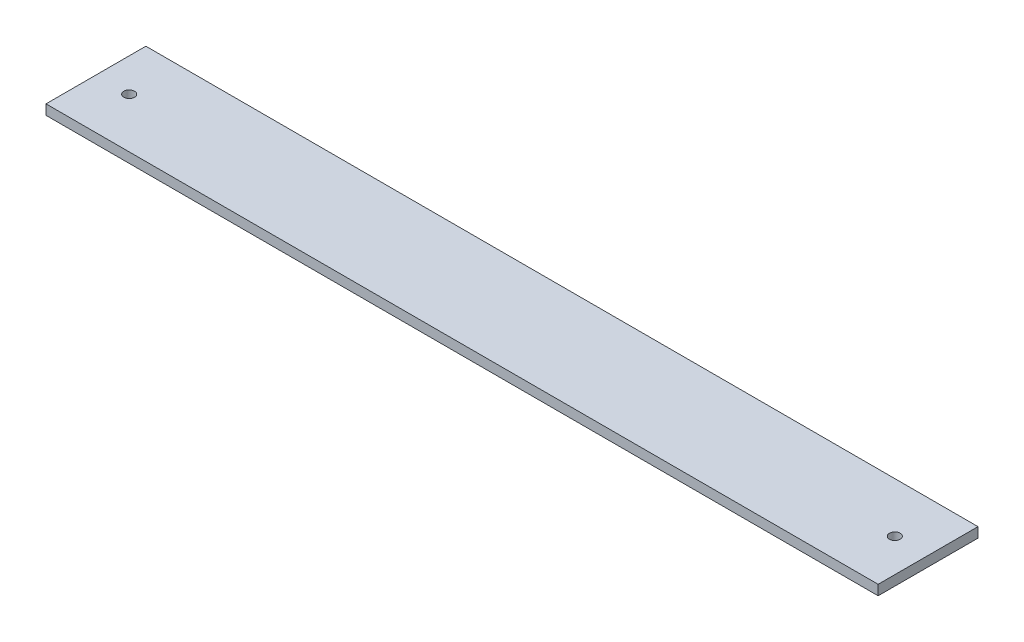
ISO-10303-21;
HEADER;
FILE_DESCRIPTION(('STEP AP214'),'2;1');
FILE_NAME('part.step','',(''),(''),'','','');
FILE_SCHEMA(('AUTOMOTIVE_DESIGN { 1 0 10303 214 1 1 1 1 }'));
ENDSEC;
DATA;
#1=APPLICATION_CONTEXT('core data for automotive mechanical design processes');
#2=APPLICATION_PROTOCOL_DEFINITION('international standard','automotive_design',2000,#1);
#3=PRODUCT_CONTEXT('',#1,'mechanical');
#4=PRODUCT('Part','Part','',(#3));
#5=PRODUCT_RELATED_PRODUCT_CATEGORY('part','',(#4));
#6=PRODUCT_DEFINITION_FORMATION('','',#4);
#7=PRODUCT_DEFINITION_CONTEXT('part definition',#1,'design');
#8=PRODUCT_DEFINITION('design','',#6,#7);
#9=PRODUCT_DEFINITION_SHAPE('','',#8);
#10=(LENGTH_UNIT() NAMED_UNIT(*) SI_UNIT(.MILLI.,.METRE.));
#11=(NAMED_UNIT(*) PLANE_ANGLE_UNIT() SI_UNIT($,.RADIAN.));
#12=(NAMED_UNIT(*) SI_UNIT($,.STERADIAN.) SOLID_ANGLE_UNIT());
#13=UNCERTAINTY_MEASURE_WITH_UNIT(LENGTH_MEASURE(1.E-05),#10,'distance_accuracy_value','');
#14=(GEOMETRIC_REPRESENTATION_CONTEXT(3) GLOBAL_UNCERTAINTY_ASSIGNED_CONTEXT((#13)) GLOBAL_UNIT_ASSIGNED_CONTEXT((#10,
#11,#12)) REPRESENTATION_CONTEXT('',''));
#15=CARTESIAN_POINT('',(0.,0.,0.));
#16=DIRECTION('',(0.,0.,1.));
#17=DIRECTION('',(1.,0.,0.));
#18=AXIS2_PLACEMENT_3D('',#15,#16,#17);
#19=CARTESIAN_POINT('',(0.,3.,0.));
#20=DIRECTION('',(0.,1.,0.));
#21=DIRECTION('',(0.,0.,1.));
#22=AXIS2_PLACEMENT_3D('',#19,#20,#21);
#23=PLANE('',#22);
#24=CARTESIAN_POINT('',(-115.,3.,0.));
#25=DIRECTION('',(0.,1.,0.));
#26=DIRECTION('',(0.,0.,1.));
#27=AXIS2_PLACEMENT_3D('',#24,#25,#26);
#28=CIRCLE('',#27,1.60000000000001);
#29=CARTESIAN_POINT('',(-115.,3.,1.60000000000003));
#30=VERTEX_POINT('',#29);
#31=EDGE_CURVE('E100',#30,#30,#28,.T.);
#32=ORIENTED_EDGE('',*,*,#31,.F.);
#33=EDGE_LOOP('',(#32));
#34=FACE_BOUND('',#33,.T.);
#35=DIRECTION('',(0.,0.,-1.));
#36=VECTOR('',#35,1.);
#37=CARTESIAN_POINT('',(125.,3.,-15.));
#38=LINE('',#37,#36);
#39=CARTESIAN_POINT('',(125.,3.,15.));
#40=VERTEX_POINT('',#39);
#41=CARTESIAN_POINT('',(125.,3.,-15.));
#42=VERTEX_POINT('',#41);
#43=EDGE_CURVE('E85',#40,#42,#38,.T.);
#44=ORIENTED_EDGE('',*,*,#43,.T.);
#45=DIRECTION('',(-1.,0.,0.));
#46=VECTOR('',#45,1.);
#47=CARTESIAN_POINT('',(-125.,3.,-15.));
#48=LINE('',#47,#46);
#49=CARTESIAN_POINT('',(-125.,3.,-15.));
#50=VERTEX_POINT('',#49);
#51=EDGE_CURVE('E80',#42,#50,#48,.T.);
#52=ORIENTED_EDGE('',*,*,#51,.T.);
#53=DIRECTION('',(0.,0.,1.));
#54=VECTOR('',#53,1.);
#55=CARTESIAN_POINT('',(-125.,3.,-15.));
#56=LINE('',#55,#54);
#57=CARTESIAN_POINT('',(-125.,3.,15.));
#58=VERTEX_POINT('',#57);
#59=EDGE_CURVE('E83',#50,#58,#56,.T.);
#60=ORIENTED_EDGE('',*,*,#59,.T.);
#61=DIRECTION('',(1.,0.,0.));
#62=VECTOR('',#61,1.);
#63=CARTESIAN_POINT('',(-125.,3.,15.));
#64=LINE('',#63,#62);
#65=EDGE_CURVE('E50',#58,#40,#64,.T.);
#66=ORIENTED_EDGE('',*,*,#65,.T.);
#67=EDGE_LOOP('',(#44,#52,#60,#66));
#68=FACE_BOUND('',#67,.T.);
#69=CARTESIAN_POINT('',(115.,3.,0.));
#70=DIRECTION('',(0.,1.,0.));
#71=DIRECTION('',(0.,0.,-1.));
#72=AXIS2_PLACEMENT_3D('',#69,#70,#71);
#73=CIRCLE('',#72,1.60000000000001);
#74=CARTESIAN_POINT('',(115.,3.,-1.59999999999998));
#75=VERTEX_POINT('',#74);
#76=EDGE_CURVE('E115',#75,#75,#73,.T.);
#77=ORIENTED_EDGE('',*,*,#76,.F.);
#78=EDGE_LOOP('',(#77));
#79=FACE_BOUND('',#78,.T.);
#80=ADVANCED_FACE('F33',(#34,#68,#79),#23,.T.);
#81=CARTESIAN_POINT('',(0.,0.,0.));
#82=DIRECTION('',(0.,1.,0.));
#83=DIRECTION('',(0.,0.,1.));
#84=AXIS2_PLACEMENT_3D('',#81,#82,#83);
#85=PLANE('',#84);
#86=DIRECTION('',(0.,0.,-1.));
#87=VECTOR('',#86,1.);
#88=CARTESIAN_POINT('',(125.,0.,-15.));
#89=LINE('',#88,#87);
#90=CARTESIAN_POINT('',(125.,0.,15.));
#91=VERTEX_POINT('',#90);
#92=CARTESIAN_POINT('',(125.,0.,-15.));
#93=VERTEX_POINT('',#92);
#94=EDGE_CURVE('E97',#91,#93,#89,.T.);
#95=ORIENTED_EDGE('',*,*,#94,.F.);
#96=DIRECTION('',(1.,0.,0.));
#97=VECTOR('',#96,1.);
#98=CARTESIAN_POINT('',(-125.,0.,15.));
#99=LINE('',#98,#97);
#100=CARTESIAN_POINT('',(-125.,0.,15.));
#101=VERTEX_POINT('',#100);
#102=EDGE_CURVE('E73',#101,#91,#99,.T.);
#103=ORIENTED_EDGE('',*,*,#102,.F.);
#104=DIRECTION('',(0.,0.,1.));
#105=VECTOR('',#104,1.);
#106=CARTESIAN_POINT('',(-125.,0.,-15.));
#107=LINE('',#106,#105);
#108=CARTESIAN_POINT('',(-125.,0.,-15.));
#109=VERTEX_POINT('',#108);
#110=EDGE_CURVE('E67',#109,#101,#107,.T.);
#111=ORIENTED_EDGE('',*,*,#110,.F.);
#112=DIRECTION('',(-1.,0.,0.));
#113=VECTOR('',#112,1.);
#114=CARTESIAN_POINT('',(-125.,0.,-15.));
#115=LINE('',#114,#113);
#116=EDGE_CURVE('E89',#93,#109,#115,.T.);
#117=ORIENTED_EDGE('',*,*,#116,.F.);
#118=EDGE_LOOP('',(#95,#103,#111,#117));
#119=FACE_BOUND('',#118,.T.);
#120=CARTESIAN_POINT('',(-115.,0.,0.));
#121=DIRECTION('',(0.,1.,0.));
#122=DIRECTION('',(0.,0.,1.));
#123=AXIS2_PLACEMENT_3D('',#120,#121,#122);
#124=CIRCLE('',#123,1.60000000000001);
#125=CARTESIAN_POINT('',(-115.,0.,1.60000000000003));
#126=VERTEX_POINT('',#125);
#127=EDGE_CURVE('E112',#126,#126,#124,.T.);
#128=ORIENTED_EDGE('',*,*,#127,.T.);
#129=EDGE_LOOP('',(#128));
#130=FACE_BOUND('',#129,.T.);
#131=CARTESIAN_POINT('',(115.,0.,0.));
#132=DIRECTION('',(0.,1.,0.));
#133=DIRECTION('',(0.,0.,-1.));
#134=AXIS2_PLACEMENT_3D('',#131,#132,#133);
#135=CIRCLE('',#134,1.60000000000001);
#136=CARTESIAN_POINT('',(115.,0.,-1.59999999999998));
#137=VERTEX_POINT('',#136);
#138=EDGE_CURVE('E118',#137,#137,#135,.T.);
#139=ORIENTED_EDGE('',*,*,#138,.T.);
#140=EDGE_LOOP('',(#139));
#141=FACE_BOUND('',#140,.T.);
#142=ADVANCED_FACE('F108',(#119,#130,#141),#85,.F.);
#143=CARTESIAN_POINT('',(125.,3.,-15.));
#144=DIRECTION('',(-1.,0.,0.));
#145=DIRECTION('',(0.,0.,1.));
#146=AXIS2_PLACEMENT_3D('',#143,#144,#145);
#147=PLANE('',#146);
#148=ORIENTED_EDGE('',*,*,#94,.T.);
#149=DIRECTION('',(0.,-1.,0.));
#150=VECTOR('',#149,1.);
#151=CARTESIAN_POINT('',(125.,3.,-15.));
#152=LINE('',#151,#150);
#153=EDGE_CURVE('E11',#42,#93,#152,.T.);
#154=ORIENTED_EDGE('',*,*,#153,.F.);
#155=ORIENTED_EDGE('',*,*,#43,.F.);
#156=DIRECTION('',(0.,-1.,0.));
#157=VECTOR('',#156,1.);
#158=CARTESIAN_POINT('',(125.,3.,15.));
#159=LINE('',#158,#157);
#160=EDGE_CURVE('E93',#40,#91,#159,.T.);
#161=ORIENTED_EDGE('',*,*,#160,.T.);
#162=EDGE_LOOP('',(#148,#154,#155,#161));
#163=FACE_BOUND('',#162,.T.);
#164=ADVANCED_FACE('F35',(#163),#147,.F.);
#165=CARTESIAN_POINT('',(-125.,3.,-15.));
#166=DIRECTION('',(0.,0.,1.));
#167=DIRECTION('',(1.,0.,0.));
#168=AXIS2_PLACEMENT_3D('',#165,#166,#167);
#169=PLANE('',#168);
#170=ORIENTED_EDGE('',*,*,#116,.T.);
#171=DIRECTION('',(0.,-1.,0.));
#172=VECTOR('',#171,1.);
#173=CARTESIAN_POINT('',(-125.,3.,-15.));
#174=LINE('',#173,#172);
#175=EDGE_CURVE('E42',#50,#109,#174,.T.);
#176=ORIENTED_EDGE('',*,*,#175,.F.);
#177=ORIENTED_EDGE('',*,*,#51,.F.);
#178=ORIENTED_EDGE('',*,*,#153,.T.);
#179=EDGE_LOOP('',(#170,#176,#177,#178));
#180=FACE_BOUND('',#179,.T.);
#181=ADVANCED_FACE('F88',(#180),#169,.F.);
#182=CARTESIAN_POINT('',(-125.,3.,-15.));
#183=DIRECTION('',(1.,0.,0.));
#184=DIRECTION('',(0.,0.,-1.));
#185=AXIS2_PLACEMENT_3D('',#182,#183,#184);
#186=PLANE('',#185);
#187=ORIENTED_EDGE('',*,*,#110,.T.);
#188=DIRECTION('',(0.,-1.,0.));
#189=VECTOR('',#188,1.);
#190=CARTESIAN_POINT('',(-125.,3.,15.));
#191=LINE('',#190,#189);
#192=EDGE_CURVE('E90',#58,#101,#191,.T.);
#193=ORIENTED_EDGE('',*,*,#192,.F.);
#194=ORIENTED_EDGE('',*,*,#59,.F.);
#195=ORIENTED_EDGE('',*,*,#175,.T.);
#196=EDGE_LOOP('',(#187,#193,#194,#195));
#197=FACE_BOUND('',#196,.T.);
#198=ADVANCED_FACE('F91',(#197),#186,.F.);
#199=CARTESIAN_POINT('',(-125.,3.,15.));
#200=DIRECTION('',(0.,0.,-1.));
#201=DIRECTION('',(-1.,0.,0.));
#202=AXIS2_PLACEMENT_3D('',#199,#200,#201);
#203=PLANE('',#202);
#204=ORIENTED_EDGE('',*,*,#102,.T.);
#205=ORIENTED_EDGE('',*,*,#160,.F.);
#206=ORIENTED_EDGE('',*,*,#65,.F.);
#207=ORIENTED_EDGE('',*,*,#192,.T.);
#208=EDGE_LOOP('',(#204,#205,#206,#207));
#209=FACE_BOUND('',#208,.T.);
#210=ADVANCED_FACE('F105',(#209),#203,.F.);
#211=CARTESIAN_POINT('',(-115.,3.,0.));
#212=DIRECTION('',(0.,-1.,0.));
#213=DIRECTION('',(0.,0.,-1.));
#214=AXIS2_PLACEMENT_3D('',#211,#212,#213);
#215=CYLINDRICAL_SURFACE('',#214,1.60000000000001);
#216=ORIENTED_EDGE('',*,*,#31,.T.);
#217=EDGE_LOOP('',(#216));
#218=FACE_BOUND('',#217,.T.);
#219=ORIENTED_EDGE('',*,*,#127,.F.);
#220=EDGE_LOOP('',(#219));
#221=FACE_BOUND('',#220,.T.);
#222=ADVANCED_FACE('F135',(#218,#221),#215,.F.);
#223=CARTESIAN_POINT('',(115.,3.,0.));
#224=DIRECTION('',(0.,-1.,0.));
#225=DIRECTION('',(0.,0.,-1.));
#226=AXIS2_PLACEMENT_3D('',#223,#224,#225);
#227=CYLINDRICAL_SURFACE('',#226,1.60000000000001);
#228=ORIENTED_EDGE('',*,*,#76,.T.);
#229=EDGE_LOOP('',(#228));
#230=FACE_BOUND('',#229,.T.);
#231=ORIENTED_EDGE('',*,*,#138,.F.);
#232=EDGE_LOOP('',(#231));
#233=FACE_BOUND('',#232,.T.);
#234=ADVANCED_FACE('F124',(#230,#233),#227,.F.);
#235=CLOSED_SHELL('',(#80,#142,#164,#181,#198,#210,#222,#234));
#236=MANIFOLD_SOLID_BREP('B2',#235);
#237=ADVANCED_BREP_SHAPE_REPRESENTATION('',(#18,#236),#14);
#238=SHAPE_DEFINITION_REPRESENTATION(#9,#237);
ENDSEC;
END-ISO-10303-21;
